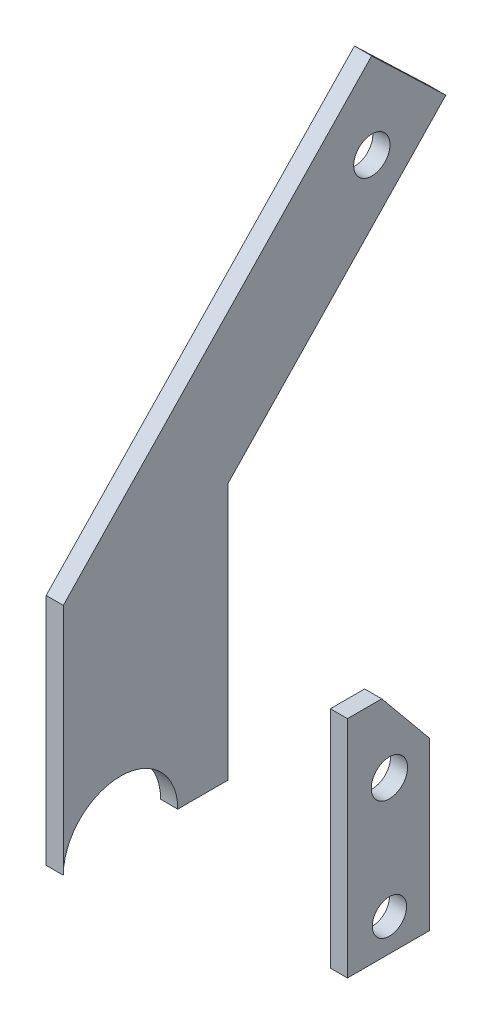
ISO-10303-21;
HEADER;
FILE_DESCRIPTION(('STEP AP214'),'2;1');
FILE_NAME('part.step','',(''),(''),'','','');
FILE_SCHEMA(('AUTOMOTIVE_DESIGN { 1 0 10303 214 1 1 1 1 }'));
ENDSEC;
DATA;
#1=APPLICATION_CONTEXT('core data for automotive mechanical design processes');
#2=APPLICATION_PROTOCOL_DEFINITION('international standard','automotive_design',2000,#1);
#3=PRODUCT_CONTEXT('',#1,'mechanical');
#4=PRODUCT('Part','Part','',(#3));
#5=PRODUCT_RELATED_PRODUCT_CATEGORY('part','',(#4));
#6=PRODUCT_DEFINITION_FORMATION('','',#4);
#7=PRODUCT_DEFINITION_CONTEXT('part definition',#1,'design');
#8=PRODUCT_DEFINITION('design','',#6,#7);
#9=PRODUCT_DEFINITION_SHAPE('','',#8);
#10=(LENGTH_UNIT() NAMED_UNIT(*) SI_UNIT(.MILLI.,.METRE.));
#11=(NAMED_UNIT(*) PLANE_ANGLE_UNIT() SI_UNIT($,.RADIAN.));
#12=(NAMED_UNIT(*) SI_UNIT($,.STERADIAN.) SOLID_ANGLE_UNIT());
#13=UNCERTAINTY_MEASURE_WITH_UNIT(LENGTH_MEASURE(1.E-05),#10,'distance_accuracy_value','');
#14=(GEOMETRIC_REPRESENTATION_CONTEXT(3) GLOBAL_UNCERTAINTY_ASSIGNED_CONTEXT((#13)) GLOBAL_UNIT_ASSIGNED_CONTEXT((#10,
#11,#12)) REPRESENTATION_CONTEXT('',''));
#15=CARTESIAN_POINT('',(0.,0.,0.));
#16=DIRECTION('',(0.,0.,1.));
#17=DIRECTION('',(1.,0.,0.));
#18=AXIS2_PLACEMENT_3D('',#15,#16,#17);
#19=CARTESIAN_POINT('',(5.,0.,0.));
#20=DIRECTION('',(1.,0.,0.));
#21=DIRECTION('',(0.,0.,-1.));
#22=AXIS2_PLACEMENT_3D('',#19,#20,#21);
#23=PLANE('',#22);
#24=CARTESIAN_POINT('',(5.,-22.9327338468267,-47.045373173437));
#25=DIRECTION('',(1.,0.,0.));
#26=DIRECTION('',(0.,0.,-1.));
#27=AXIS2_PLACEMENT_3D('',#24,#25,#26);
#28=CIRCLE('',#27,5.29999999999997);
#29=CARTESIAN_POINT('',(5.,-22.9327338468267,-52.3453731734369));
#30=VERTEX_POINT('',#29);
#31=EDGE_CURVE('E122',#30,#30,#28,.T.);
#32=ORIENTED_EDGE('',*,*,#31,.F.);
#33=EDGE_LOOP('',(#32));
#34=FACE_BOUND('',#33,.T.);
#35=DIRECTION('',(0.,0.,-1.));
#36=VECTOR('',#35,1.);
#37=CARTESIAN_POINT('',(5.,-67.3955955210605,-34.8119119531213));
#38=LINE('',#37,#36);
#39=CARTESIAN_POINT('',(5.,-67.3955955210605,-34.8119119531213));
#40=VERTEX_POINT('',#39);
#41=CARTESIAN_POINT('',(5.,-67.3955955210605,-58.8026103800072));
#42=VERTEX_POINT('',#41);
#43=EDGE_CURVE('E127',#40,#42,#38,.T.);
#44=ORIENTED_EDGE('',*,*,#43,.T.);
#45=DIRECTION('',(0.,1.,0.));
#46=VECTOR('',#45,1.);
#47=CARTESIAN_POINT('',(5.,-67.3955955210605,-58.8026103800072));
#48=LINE('',#47,#46);
#49=CARTESIAN_POINT('',(5.,-18.8378197070937,-58.8026103800072));
#50=VERTEX_POINT('',#49);
#51=EDGE_CURVE('E94',#42,#50,#48,.T.);
#52=ORIENTED_EDGE('',*,*,#51,.T.);
#53=DIRECTION('',(0.,0.771737812401835,0.635940837585722));
#54=VECTOR('',#53,1.);
#55=CARTESIAN_POINT('',(5.,-18.8378197070937,-58.8026103800072));
#56=LINE('',#55,#54);
#57=CARTESIAN_POINT('',(5.,-1.85958783425334,-44.8119119531213));
#58=VERTEX_POINT('',#57);
#59=EDGE_CURVE('E98',#50,#58,#56,.T.);
#60=ORIENTED_EDGE('',*,*,#59,.T.);
#61=DIRECTION('',(0.,0.,1.));
#62=VECTOR('',#61,1.);
#63=CARTESIAN_POINT('',(5.,-1.85958783425334,-44.8119119531213));
#64=LINE('',#63,#62);
#65=CARTESIAN_POINT('',(5.,-1.85958783425334,-34.8119119531212));
#66=VERTEX_POINT('',#65);
#67=EDGE_CURVE('E102',#58,#66,#64,.T.);
#68=ORIENTED_EDGE('',*,*,#67,.T.);
#69=DIRECTION('',(0.,-1.,0.));
#70=VECTOR('',#69,1.);
#71=CARTESIAN_POINT('',(5.,-1.85958783425334,-34.8119119531212));
#72=LINE('',#71,#70);
#73=EDGE_CURVE('E60',#66,#40,#72,.T.);
#74=ORIENTED_EDGE('',*,*,#73,.T.);
#75=EDGE_LOOP('',(#44,#52,#60,#68,#74));
#76=FACE_BOUND('',#75,.T.);
#77=CARTESIAN_POINT('',(5.,-57.9447750543972,-47.0453731734369));
#78=DIRECTION('',(1.,0.,0.));
#79=DIRECTION('',(0.,0.,-1.));
#80=AXIS2_PLACEMENT_3D('',#77,#78,#79);
#81=CIRCLE('',#80,5.00000000000002);
#82=CARTESIAN_POINT('',(5.,-57.9447750543972,-52.0453731734369));
#83=VERTEX_POINT('',#82);
#84=EDGE_CURVE('E165',#83,#83,#81,.T.);
#85=ORIENTED_EDGE('',*,*,#84,.F.);
#86=EDGE_LOOP('',(#85));
#87=FACE_BOUND('',#86,.T.);
#88=ADVANCED_FACE('F43',(#34,#76,#87),#23,.T.);
#89=CARTESIAN_POINT('',(0.,0.,0.));
#90=DIRECTION('',(1.,0.,0.));
#91=DIRECTION('',(0.,0.,-1.));
#92=AXIS2_PLACEMENT_3D('',#89,#90,#91);
#93=PLANE('',#92);
#94=CARTESIAN_POINT('',(0.,-22.9327338468267,-47.045373173437));
#95=DIRECTION('',(1.,0.,0.));
#96=DIRECTION('',(0.,0.,-1.));
#97=AXIS2_PLACEMENT_3D('',#94,#95,#96);
#98=CIRCLE('',#97,5.29999999999997);
#99=CARTESIAN_POINT('',(0.,-22.9327338468267,-52.3453731734369));
#100=VERTEX_POINT('',#99);
#101=EDGE_CURVE('E170',#100,#100,#98,.T.);
#102=ORIENTED_EDGE('',*,*,#101,.T.);
#103=EDGE_LOOP('',(#102));
#104=FACE_BOUND('',#103,.T.);
#105=DIRECTION('',(0.,0.,-1.));
#106=VECTOR('',#105,1.);
#107=CARTESIAN_POINT('',(0.,-67.3955955210605,-34.8119119531213));
#108=LINE('',#107,#106);
#109=CARTESIAN_POINT('',(0.,-67.3955955210605,-34.8119119531213));
#110=VERTEX_POINT('',#109);
#111=CARTESIAN_POINT('',(0.,-67.3955955210605,-58.8026103800072));
#112=VERTEX_POINT('',#111);
#113=EDGE_CURVE('E118',#110,#112,#108,.T.);
#114=ORIENTED_EDGE('',*,*,#113,.F.);
#115=DIRECTION('',(0.,-1.,0.));
#116=VECTOR('',#115,1.);
#117=CARTESIAN_POINT('',(0.,-1.85958783425334,-34.8119119531212));
#118=LINE('',#117,#116);
#119=CARTESIAN_POINT('',(0.,-1.85958783425334,-34.8119119531212));
#120=VERTEX_POINT('',#119);
#121=EDGE_CURVE('E86',#120,#110,#118,.T.);
#122=ORIENTED_EDGE('',*,*,#121,.F.);
#123=DIRECTION('',(0.,0.,1.));
#124=VECTOR('',#123,1.);
#125=CARTESIAN_POINT('',(0.,-1.85958783425334,-44.8119119531213));
#126=LINE('',#125,#124);
#127=CARTESIAN_POINT('',(0.,-1.85958783425334,-44.8119119531213));
#128=VERTEX_POINT('',#127);
#129=EDGE_CURVE('E80',#128,#120,#126,.T.);
#130=ORIENTED_EDGE('',*,*,#129,.F.);
#131=DIRECTION('',(0.,0.771737812401835,0.635940837585722));
#132=VECTOR('',#131,1.);
#133=CARTESIAN_POINT('',(0.,-18.8378197070937,-58.8026103800072));
#134=LINE('',#133,#132);
#135=CARTESIAN_POINT('',(0.,-18.8378197070937,-58.8026103800072));
#136=VERTEX_POINT('',#135);
#137=EDGE_CURVE('E109',#136,#128,#134,.T.);
#138=ORIENTED_EDGE('',*,*,#137,.F.);
#139=DIRECTION('',(0.,1.,0.));
#140=VECTOR('',#139,1.);
#141=CARTESIAN_POINT('',(0.,-67.3955955210605,-58.8026103800072));
#142=LINE('',#141,#140);
#143=EDGE_CURVE('E121',#112,#136,#142,.T.);
#144=ORIENTED_EDGE('',*,*,#143,.F.);
#145=EDGE_LOOP('',(#114,#122,#130,#138,#144));
#146=FACE_BOUND('',#145,.T.);
#147=CARTESIAN_POINT('',(0.,-57.9447750543972,-47.0453731734369));
#148=DIRECTION('',(1.,0.,0.));
#149=DIRECTION('',(0.,0.,-1.));
#150=AXIS2_PLACEMENT_3D('',#147,#148,#149);
#151=CIRCLE('',#150,5.00000000000002);
#152=CARTESIAN_POINT('',(0.,-57.9447750543972,-52.0453731734369));
#153=VERTEX_POINT('',#152);
#154=EDGE_CURVE('E168',#153,#153,#151,.T.);
#155=ORIENTED_EDGE('',*,*,#154,.T.);
#156=EDGE_LOOP('',(#155));
#157=FACE_BOUND('',#156,.T.);
#158=ADVANCED_FACE('F131',(#104,#146,#157),#93,.F.);
#159=CARTESIAN_POINT('',(5.,-67.3955955210605,-34.8119119531213));
#160=DIRECTION('',(0.,1.,0.));
#161=DIRECTION('',(0.,0.,1.));
#162=AXIS2_PLACEMENT_3D('',#159,#160,#161);
#163=PLANE('',#162);
#164=ORIENTED_EDGE('',*,*,#113,.T.);
#165=DIRECTION('',(-1.,0.,0.));
#166=VECTOR('',#165,1.);
#167=CARTESIAN_POINT('',(5.,-67.3955955210605,-58.8026103800072));
#168=LINE('',#167,#166);
#169=EDGE_CURVE('E12',#42,#112,#168,.T.);
#170=ORIENTED_EDGE('',*,*,#169,.F.);
#171=ORIENTED_EDGE('',*,*,#43,.F.);
#172=DIRECTION('',(-1.,0.,0.));
#173=VECTOR('',#172,1.);
#174=CARTESIAN_POINT('',(5.,-67.3955955210605,-34.8119119531213));
#175=LINE('',#174,#173);
#176=EDGE_CURVE('E114',#40,#110,#175,.T.);
#177=ORIENTED_EDGE('',*,*,#176,.T.);
#178=EDGE_LOOP('',(#164,#170,#171,#177));
#179=FACE_BOUND('',#178,.T.);
#180=ADVANCED_FACE('F45',(#179),#163,.F.);
#181=CARTESIAN_POINT('',(5.,-67.3955955210605,-58.8026103800072));
#182=DIRECTION('',(0.,0.,1.));
#183=DIRECTION('',(1.,0.,0.));
#184=AXIS2_PLACEMENT_3D('',#181,#182,#183);
#185=PLANE('',#184);
#186=ORIENTED_EDGE('',*,*,#143,.T.);
#187=DIRECTION('',(-1.,0.,0.));
#188=VECTOR('',#187,1.);
#189=CARTESIAN_POINT('',(5.,-18.8378197070937,-58.8026103800072));
#190=LINE('',#189,#188);
#191=EDGE_CURVE('E52',#50,#136,#190,.T.);
#192=ORIENTED_EDGE('',*,*,#191,.F.);
#193=ORIENTED_EDGE('',*,*,#51,.F.);
#194=ORIENTED_EDGE('',*,*,#169,.T.);
#195=EDGE_LOOP('',(#186,#192,#193,#194));
#196=FACE_BOUND('',#195,.T.);
#197=ADVANCED_FACE('F202',(#196),#185,.F.);
#198=CARTESIAN_POINT('',(5.,-18.8378197070937,-58.8026103800072));
#199=DIRECTION('',(0.,-0.635940837585722,0.771737812401835));
#200=DIRECTION('',(0.,-0.771737812401835,-0.635940837585722));
#201=AXIS2_PLACEMENT_3D('',#198,#199,#200);
#202=PLANE('',#201);
#203=ORIENTED_EDGE('',*,*,#137,.T.);
#204=DIRECTION('',(-1.,0.,0.));
#205=VECTOR('',#204,1.);
#206=CARTESIAN_POINT('',(5.,-1.85958783425334,-44.8119119531213));
#207=LINE('',#206,#205);
#208=EDGE_CURVE('E106',#58,#128,#207,.T.);
#209=ORIENTED_EDGE('',*,*,#208,.F.);
#210=ORIENTED_EDGE('',*,*,#59,.F.);
#211=ORIENTED_EDGE('',*,*,#191,.T.);
#212=EDGE_LOOP('',(#203,#209,#210,#211));
#213=FACE_BOUND('',#212,.T.);
#214=ADVANCED_FACE('F107',(#213),#202,.F.);
#215=CARTESIAN_POINT('',(5.,-1.85958783425334,-44.8119119531213));
#216=DIRECTION('',(0.,-1.,0.));
#217=DIRECTION('',(0.,0.,-1.));
#218=AXIS2_PLACEMENT_3D('',#215,#216,#217);
#219=PLANE('',#218);
#220=ORIENTED_EDGE('',*,*,#129,.T.);
#221=DIRECTION('',(-1.,0.,0.));
#222=VECTOR('',#221,1.);
#223=CARTESIAN_POINT('',(5.,-1.85958783425334,-34.8119119531212));
#224=LINE('',#223,#222);
#225=EDGE_CURVE('E110',#66,#120,#224,.T.);
#226=ORIENTED_EDGE('',*,*,#225,.F.);
#227=ORIENTED_EDGE('',*,*,#67,.F.);
#228=ORIENTED_EDGE('',*,*,#208,.T.);
#229=EDGE_LOOP('',(#220,#226,#227,#228));
#230=FACE_BOUND('',#229,.T.);
#231=ADVANCED_FACE('F112',(#230),#219,.F.);
#232=CARTESIAN_POINT('',(5.,-1.85958783425334,-34.8119119531212));
#233=DIRECTION('',(0.,0.,-1.));
#234=DIRECTION('',(0.,1.,0.));
#235=AXIS2_PLACEMENT_3D('',#232,#233,#234);
#236=PLANE('',#235);
#237=ORIENTED_EDGE('',*,*,#121,.T.);
#238=ORIENTED_EDGE('',*,*,#176,.F.);
#239=ORIENTED_EDGE('',*,*,#73,.F.);
#240=ORIENTED_EDGE('',*,*,#225,.T.);
#241=EDGE_LOOP('',(#237,#238,#239,#240));
#242=FACE_BOUND('',#241,.T.);
#243=ADVANCED_FACE('F136',(#242),#236,.F.);
#244=CARTESIAN_POINT('',(5.,-22.9327338468267,-47.045373173437));
#245=DIRECTION('',(-1.,0.,0.));
#246=DIRECTION('',(0.,0.,1.));
#247=AXIS2_PLACEMENT_3D('',#244,#245,#246);
#248=CYLINDRICAL_SURFACE('',#247,5.29999999999997);
#249=ORIENTED_EDGE('',*,*,#31,.T.);
#250=EDGE_LOOP('',(#249));
#251=FACE_BOUND('',#250,.T.);
#252=ORIENTED_EDGE('',*,*,#101,.F.);
#253=EDGE_LOOP('',(#252));
#254=FACE_BOUND('',#253,.T.);
#255=ADVANCED_FACE('F138',(#251,#254),#248,.F.);
#256=CARTESIAN_POINT('',(5.,-57.9447750543972,-47.0453731734369));
#257=DIRECTION('',(-1.,0.,0.));
#258=DIRECTION('',(0.,0.,1.));
#259=AXIS2_PLACEMENT_3D('',#256,#257,#258);
#260=CYLINDRICAL_SURFACE('',#259,5.00000000000002);
#261=ORIENTED_EDGE('',*,*,#84,.T.);
#262=EDGE_LOOP('',(#261));
#263=FACE_BOUND('',#262,.T.);
#264=ORIENTED_EDGE('',*,*,#154,.F.);
#265=EDGE_LOOP('',(#264));
#266=FACE_BOUND('',#265,.T.);
#267=ADVANCED_FACE('F144',(#263,#266),#260,.F.);
#268=CLOSED_SHELL('',(#88,#158,#180,#197,#214,#231,#243,#255,#267));
#269=MANIFOLD_SOLID_BREP('B2',#268);
#270=CARTESIAN_POINT('',(5.,0.0179912585134923,31.3997237600732));
#271=DIRECTION('',(1.,0.,0.));
#272=DIRECTION('',(0.,0.,-1.));
#273=AXIS2_PLACEMENT_3D('',#270,#271,#272);
#274=PLANE('',#273);
#275=DIRECTION('',(0.,0.691965134103961,0.721930919953209));
#276=VECTOR('',#275,1.);
#277=CARTESIAN_POINT('',(5.,141.304300069732,-63.5131712720376));
#278=LINE('',#277,#276);
#279=CARTESIAN_POINT('',(5.,141.304300069732,-63.5131712720376));
#280=VERTEX_POINT('',#279);
#281=CARTESIAN_POINT('',(5.,162.06325409285,-41.8552436734415));
#282=VERTEX_POINT('',#281);
#283=EDGE_CURVE('E341',#280,#282,#278,.T.);
#284=ORIENTED_EDGE('',*,*,#283,.T.);
#285=DIRECTION('',(0.,-0.721930919953209,0.691965134103961));
#286=VECTOR('',#285,1.);
#287=CARTESIAN_POINT('',(5.,162.06325409285,-41.8552436734415));
#288=LINE('',#287,#286);
#289=CARTESIAN_POINT('',(5.,68.2122344989333,48.1002237600732));
#290=VERTEX_POINT('',#289);
#291=EDGE_CURVE('E290',#282,#290,#288,.T.);
#292=ORIENTED_EDGE('',*,*,#291,.T.);
#293=DIRECTION('',(0.,-1.,0.));
#294=VECTOR('',#293,1.);
#295=CARTESIAN_POINT('',(5.,68.2122344989333,48.1002237600732));
#296=LINE('',#295,#294);
#297=CARTESIAN_POINT('',(5.,0.0179912585134869,48.1002237600732));
#298=VERTEX_POINT('',#297);
#299=EDGE_CURVE('E353',#290,#298,#296,.T.);
#300=ORIENTED_EDGE('',*,*,#299,.T.);
#301=CARTESIAN_POINT('',(5.,0.0179912585134923,31.3997237600732));
#302=DIRECTION('',(-1.,0.,0.));
#303=DIRECTION('',(0.,0.,-1.));
#304=AXIS2_PLACEMENT_3D('',#301,#302,#303);
#305=CIRCLE('',#304,16.7004999999999);
#306=CARTESIAN_POINT('',(5.,0.0179912585134864,14.6992237600733));
#307=VERTEX_POINT('',#306);
#308=EDGE_CURVE('E307',#298,#307,#305,.T.);
#309=ORIENTED_EDGE('',*,*,#308,.T.);
#310=DIRECTION('',(0.,0.,-1.));
#311=VECTOR('',#310,1.);
#312=CARTESIAN_POINT('',(5.,0.0179912585134923,0.0217367061159041));
#313=LINE('',#312,#311);
#314=CARTESIAN_POINT('',(5.,0.0179912585134923,0.0217367061159041));
#315=VERTEX_POINT('',#314);
#316=EDGE_CURVE('E300',#307,#315,#313,.T.);
#317=ORIENTED_EDGE('',*,*,#316,.T.);
#318=DIRECTION('',(0.,1.,0.));
#319=VECTOR('',#318,1.);
#320=CARTESIAN_POINT('',(5.,75.0179912585139,0.0217367061159102));
#321=LINE('',#320,#319);
#322=CARTESIAN_POINT('',(5.,75.0179912585139,0.0217367061159102));
#323=VERTEX_POINT('',#322);
#324=EDGE_CURVE('E304',#315,#323,#321,.T.);
#325=ORIENTED_EDGE('',*,*,#324,.T.);
#326=DIRECTION('',(0.,0.721930919953209,-0.691965134103961));
#327=VECTOR('',#326,1.);
#328=CARTESIAN_POINT('',(5.,112.427063271603,-35.8345659078793));
#329=LINE('',#328,#327);
#330=EDGE_CURVE('E252',#323,#280,#329,.T.);
#331=ORIENTED_EDGE('',*,*,#330,.T.);
#332=EDGE_LOOP('',(#284,#292,#300,#309,#317,#325,#331));
#333=FACE_BOUND('',#332,.T.);
#334=CARTESIAN_POINT('',(5.,136.985296196016,-41.9171932340762));
#335=DIRECTION('',(1.,0.,0.));
#336=DIRECTION('',(0.,0.,-1.));
#337=AXIS2_PLACEMENT_3D('',#334,#335,#336);
#338=CIRCLE('',#337,5.3);
#339=CARTESIAN_POINT('',(5.,136.985296196016,-47.2171932340762));
#340=VERTEX_POINT('',#339);
#341=EDGE_CURVE('E331',#340,#340,#338,.T.);
#342=ORIENTED_EDGE('',*,*,#341,.F.);
#343=EDGE_LOOP('',(#342));
#344=FACE_BOUND('',#343,.T.);
#345=ADVANCED_FACE('F235',(#333,#344),#274,.T.);
#346=CARTESIAN_POINT('',(0.,0.0179912585134923,31.3997237600732));
#347=DIRECTION('',(1.,0.,0.));
#348=DIRECTION('',(0.,0.,-1.));
#349=AXIS2_PLACEMENT_3D('',#346,#347,#348);
#350=PLANE('',#349);
#351=DIRECTION('',(0.,0.691965134103961,0.721930919953209));
#352=VECTOR('',#351,1.);
#353=CARTESIAN_POINT('',(0.,141.304300069732,-63.5131712720376));
#354=LINE('',#353,#352);
#355=CARTESIAN_POINT('',(0.,141.304300069732,-63.5131712720376));
#356=VERTEX_POINT('',#355);
#357=CARTESIAN_POINT('',(0.,162.06325409285,-41.8552436734415));
#358=VERTEX_POINT('',#357);
#359=EDGE_CURVE('E327',#356,#358,#354,.T.);
#360=ORIENTED_EDGE('',*,*,#359,.F.);
#361=DIRECTION('',(0.,0.721930919953209,-0.691965134103961));
#362=VECTOR('',#361,1.);
#363=CARTESIAN_POINT('',(0.,141.304300069732,-63.5131712720376));
#364=LINE('',#363,#362);
#365=CARTESIAN_POINT('',(0.,75.0179912585139,0.0217367061159102));
#366=VERTEX_POINT('',#365);
#367=EDGE_CURVE('E278',#366,#356,#364,.T.);
#368=ORIENTED_EDGE('',*,*,#367,.F.);
#369=DIRECTION('',(0.,1.,0.));
#370=VECTOR('',#369,1.);
#371=CARTESIAN_POINT('',(0.,75.0179912585139,0.0217367061159102));
#372=LINE('',#371,#370);
#373=CARTESIAN_POINT('',(0.,0.0179912585134923,0.0217367061159041));
#374=VERTEX_POINT('',#373);
#375=EDGE_CURVE('E338',#374,#366,#372,.T.);
#376=ORIENTED_EDGE('',*,*,#375,.F.);
#377=DIRECTION('',(0.,0.,-1.));
#378=VECTOR('',#377,1.);
#379=CARTESIAN_POINT('',(0.,0.0179912585134923,0.0217367061159041));
#380=LINE('',#379,#378);
#381=CARTESIAN_POINT('',(0.,0.0179912585134864,14.6992237600733));
#382=VERTEX_POINT('',#381);
#383=EDGE_CURVE('E316',#382,#374,#380,.T.);
#384=ORIENTED_EDGE('',*,*,#383,.F.);
#385=CARTESIAN_POINT('',(0.,0.0179912585134923,31.3997237600732));
#386=DIRECTION('',(-1.,0.,0.));
#387=DIRECTION('',(0.,0.,-1.));
#388=AXIS2_PLACEMENT_3D('',#385,#386,#387);
#389=CIRCLE('',#388,16.7004999999999);
#390=CARTESIAN_POINT('',(0.,0.0179912585134869,48.1002237600732));
#391=VERTEX_POINT('',#390);
#392=EDGE_CURVE('E335',#391,#382,#389,.T.);
#393=ORIENTED_EDGE('',*,*,#392,.F.);
#394=DIRECTION('',(0.,-1.,0.));
#395=VECTOR('',#394,1.);
#396=CARTESIAN_POINT('',(0.,68.2122344989333,48.1002237600732));
#397=LINE('',#396,#395);
#398=CARTESIAN_POINT('',(0.,68.2122344989333,48.1002237600732));
#399=VERTEX_POINT('',#398);
#400=EDGE_CURVE('E333',#399,#391,#397,.T.);
#401=ORIENTED_EDGE('',*,*,#400,.F.);
#402=DIRECTION('',(0.,-0.721930919953209,0.691965134103961));
#403=VECTOR('',#402,1.);
#404=CARTESIAN_POINT('',(0.,133.186017294722,-14.1766383092833));
#405=LINE('',#404,#403);
#406=EDGE_CURVE('E330',#358,#399,#405,.T.);
#407=ORIENTED_EDGE('',*,*,#406,.F.);
#408=EDGE_LOOP('',(#360,#368,#376,#384,#393,#401,#407));
#409=FACE_BOUND('',#408,.T.);
#410=CARTESIAN_POINT('',(0.,136.985296196016,-41.9171932340762));
#411=DIRECTION('',(1.,0.,0.));
#412=DIRECTION('',(0.,0.,-1.));
#413=AXIS2_PLACEMENT_3D('',#410,#411,#412);
#414=CIRCLE('',#413,5.3);
#415=CARTESIAN_POINT('',(0.,136.985296196016,-47.2171932340762));
#416=VERTEX_POINT('',#415);
#417=EDGE_CURVE('E363',#416,#416,#414,.T.);
#418=ORIENTED_EDGE('',*,*,#417,.T.);
#419=EDGE_LOOP('',(#418));
#420=FACE_BOUND('',#419,.T.);
#421=ADVANCED_FACE('F355',(#409,#420),#350,.F.);
#422=CARTESIAN_POINT('',(5.,141.304300069732,-63.5131712720376));
#423=DIRECTION('',(0.,-0.721930919953209,0.691965134103961));
#424=DIRECTION('',(0.,-0.691965134103961,-0.721930919953209));
#425=AXIS2_PLACEMENT_3D('',#422,#423,#424);
#426=PLANE('',#425);
#427=ORIENTED_EDGE('',*,*,#359,.T.);
#428=DIRECTION('',(-1.,0.,0.));
#429=VECTOR('',#428,1.);
#430=CARTESIAN_POINT('',(5.,162.06325409285,-41.8552436734415));
#431=LINE('',#430,#429);
#432=EDGE_CURVE('E41',#282,#358,#431,.T.);
#433=ORIENTED_EDGE('',*,*,#432,.F.);
#434=ORIENTED_EDGE('',*,*,#283,.F.);
#435=DIRECTION('',(-1.,0.,0.));
#436=VECTOR('',#435,1.);
#437=CARTESIAN_POINT('',(5.,141.304300069732,-63.5131712720376));
#438=LINE('',#437,#436);
#439=EDGE_CURVE('E323',#280,#356,#438,.T.);
#440=ORIENTED_EDGE('',*,*,#439,.T.);
#441=EDGE_LOOP('',(#427,#433,#434,#440));
#442=FACE_BOUND('',#441,.T.);
#443=ADVANCED_FACE('F237',(#442),#426,.F.);
#444=CARTESIAN_POINT('',(5.,133.186017294722,-14.1766383092833));
#445=DIRECTION('',(0.,-0.691965134103961,-0.721930919953209));
#446=DIRECTION('',(0.,0.721930919953209,-0.691965134103961));
#447=AXIS2_PLACEMENT_3D('',#444,#445,#446);
#448=PLANE('',#447);
#449=ORIENTED_EDGE('',*,*,#406,.T.);
#450=DIRECTION('',(-1.,0.,0.));
#451=VECTOR('',#450,1.);
#452=CARTESIAN_POINT('',(5.,68.2122344989333,48.1002237600732));
#453=LINE('',#452,#451);
#454=EDGE_CURVE('E244',#290,#399,#453,.T.);
#455=ORIENTED_EDGE('',*,*,#454,.F.);
#456=ORIENTED_EDGE('',*,*,#291,.F.);
#457=ORIENTED_EDGE('',*,*,#432,.T.);
#458=EDGE_LOOP('',(#449,#455,#456,#457));
#459=FACE_BOUND('',#458,.T.);
#460=ADVANCED_FACE('F389',(#459),#448,.F.);
#461=CARTESIAN_POINT('',(5.,68.2122344989333,48.1002237600732));
#462=DIRECTION('',(0.,0.,-1.));
#463=DIRECTION('',(0.,1.,0.));
#464=AXIS2_PLACEMENT_3D('',#461,#462,#463);
#465=PLANE('',#464);
#466=ORIENTED_EDGE('',*,*,#400,.T.);
#467=DIRECTION('',(-1.,0.,0.));
#468=VECTOR('',#467,1.);
#469=CARTESIAN_POINT('',(5.,0.0179912585134869,48.1002237600732));
#470=LINE('',#469,#468);
#471=EDGE_CURVE('E345',#298,#391,#470,.T.);
#472=ORIENTED_EDGE('',*,*,#471,.F.);
#473=ORIENTED_EDGE('',*,*,#299,.F.);
#474=ORIENTED_EDGE('',*,*,#454,.T.);
#475=EDGE_LOOP('',(#466,#472,#473,#474));
#476=FACE_BOUND('',#475,.T.);
#477=ADVANCED_FACE('F351',(#476),#465,.F.);
#478=CARTESIAN_POINT('',(5.,0.0179912585134923,31.3997237600732));
#479=DIRECTION('',(-1.,0.,0.));
#480=DIRECTION('',(0.,0.,1.));
#481=AXIS2_PLACEMENT_3D('',#478,#479,#480);
#482=CYLINDRICAL_SURFACE('',#481,16.7004999999999);
#483=ORIENTED_EDGE('',*,*,#392,.T.);
#484=DIRECTION('',(-1.,0.,0.));
#485=VECTOR('',#484,1.);
#486=CARTESIAN_POINT('',(5.,0.0179912585134864,14.6992237600733));
#487=LINE('',#486,#485);
#488=EDGE_CURVE('E318',#307,#382,#487,.T.);
#489=ORIENTED_EDGE('',*,*,#488,.F.);
#490=ORIENTED_EDGE('',*,*,#308,.F.);
#491=ORIENTED_EDGE('',*,*,#471,.T.);
#492=EDGE_LOOP('',(#483,#489,#490,#491));
#493=FACE_BOUND('',#492,.T.);
#494=ADVANCED_FACE('F358',(#493),#482,.F.);
#495=CARTESIAN_POINT('',(5.,0.0179912585134923,0.0217367061159041));
#496=DIRECTION('',(0.,1.,0.));
#497=DIRECTION('',(0.,0.,1.));
#498=AXIS2_PLACEMENT_3D('',#495,#496,#497);
#499=PLANE('',#498);
#500=ORIENTED_EDGE('',*,*,#383,.T.);
#501=DIRECTION('',(-1.,0.,0.));
#502=VECTOR('',#501,1.);
#503=CARTESIAN_POINT('',(5.,0.0179912585134923,0.0217367061159041));
#504=LINE('',#503,#502);
#505=EDGE_CURVE('E313',#315,#374,#504,.T.);
#506=ORIENTED_EDGE('',*,*,#505,.F.);
#507=ORIENTED_EDGE('',*,*,#316,.F.);
#508=ORIENTED_EDGE('',*,*,#488,.T.);
#509=EDGE_LOOP('',(#500,#506,#507,#508));
#510=FACE_BOUND('',#509,.T.);
#511=ADVANCED_FACE('F314',(#510),#499,.F.);
#512=CARTESIAN_POINT('',(5.,75.0179912585139,0.0217367061159102));
#513=DIRECTION('',(0.,0.,1.));
#514=DIRECTION('',(0.,-1.,0.));
#515=AXIS2_PLACEMENT_3D('',#512,#513,#514);
#516=PLANE('',#515);
#517=ORIENTED_EDGE('',*,*,#375,.T.);
#518=DIRECTION('',(-1.,0.,0.));
#519=VECTOR('',#518,1.);
#520=CARTESIAN_POINT('',(5.,75.0179912585139,0.0217367061159102));
#521=LINE('',#520,#519);
#522=EDGE_CURVE('E319',#323,#366,#521,.T.);
#523=ORIENTED_EDGE('',*,*,#522,.F.);
#524=ORIENTED_EDGE('',*,*,#324,.F.);
#525=ORIENTED_EDGE('',*,*,#505,.T.);
#526=EDGE_LOOP('',(#517,#523,#524,#525));
#527=FACE_BOUND('',#526,.T.);
#528=ADVANCED_FACE('F321',(#527),#516,.F.);
#529=CARTESIAN_POINT('',(5.,141.304300069732,-63.5131712720376));
#530=DIRECTION('',(0.,0.691965134103961,0.721930919953209));
#531=DIRECTION('',(0.,-0.721930919953209,0.691965134103961));
#532=AXIS2_PLACEMENT_3D('',#529,#530,#531);
#533=PLANE('',#532);
#534=ORIENTED_EDGE('',*,*,#367,.T.);
#535=ORIENTED_EDGE('',*,*,#439,.F.);
#536=ORIENTED_EDGE('',*,*,#330,.F.);
#537=ORIENTED_EDGE('',*,*,#522,.T.);
#538=EDGE_LOOP('',(#534,#535,#536,#537));
#539=FACE_BOUND('',#538,.T.);
#540=ADVANCED_FACE('F379',(#539),#533,.F.);
#541=CARTESIAN_POINT('',(5.,136.985296196016,-41.9171932340762));
#542=DIRECTION('',(-1.,0.,0.));
#543=DIRECTION('',(0.,0.,1.));
#544=AXIS2_PLACEMENT_3D('',#541,#542,#543);
#545=CYLINDRICAL_SURFACE('',#544,5.3);
#546=ORIENTED_EDGE('',*,*,#341,.T.);
#547=EDGE_LOOP('',(#546));
#548=FACE_BOUND('',#547,.T.);
#549=ORIENTED_EDGE('',*,*,#417,.F.);
#550=EDGE_LOOP('',(#549));
#551=FACE_BOUND('',#550,.T.);
#552=ADVANCED_FACE('F369',(#548,#551),#545,.F.);
#553=CLOSED_SHELL('',(#345,#421,#443,#460,#477,#494,#511,#528,#540,#552));
#554=MANIFOLD_SOLID_BREP('B6',#553);
#555=ADVANCED_BREP_SHAPE_REPRESENTATION('',(#18,#269,#554),#14);
#556=SHAPE_DEFINITION_REPRESENTATION(#9,#555);
ENDSEC;
END-ISO-10303-21;
